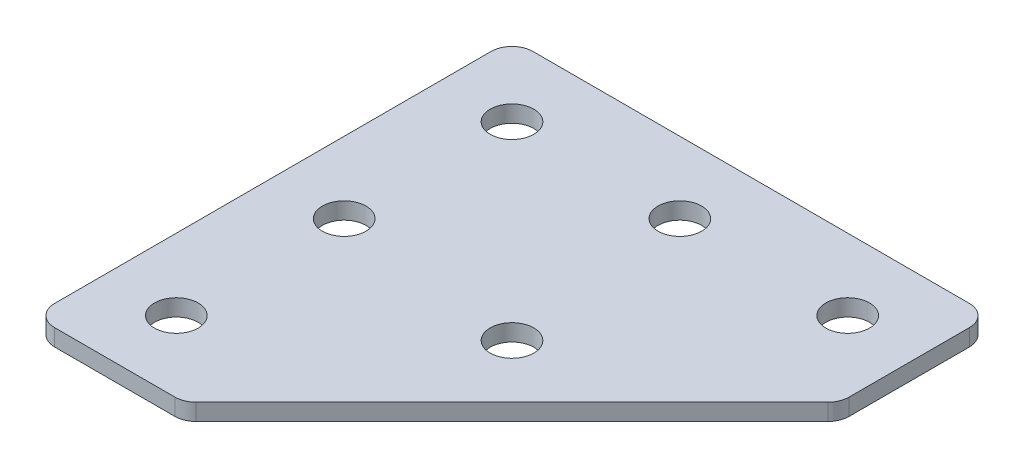
ISO-10303-21;
HEADER;
FILE_DESCRIPTION(('STEP AP214'),'2;1');
FILE_NAME('part.step','',(''),(''),'','','');
FILE_SCHEMA(('AUTOMOTIVE_DESIGN { 1 0 10303 214 1 1 1 1 }'));
ENDSEC;
DATA;
#1=APPLICATION_CONTEXT('core data for automotive mechanical design processes');
#2=APPLICATION_PROTOCOL_DEFINITION('international standard','automotive_design',2000,#1);
#3=PRODUCT_CONTEXT('',#1,'mechanical');
#4=PRODUCT('Part','Part','',(#3));
#5=PRODUCT_RELATED_PRODUCT_CATEGORY('part','',(#4));
#6=PRODUCT_DEFINITION_FORMATION('','',#4);
#7=PRODUCT_DEFINITION_CONTEXT('part definition',#1,'design');
#8=PRODUCT_DEFINITION('design','',#6,#7);
#9=PRODUCT_DEFINITION_SHAPE('','',#8);
#10=(LENGTH_UNIT() NAMED_UNIT(*) SI_UNIT(.MILLI.,.METRE.));
#11=(NAMED_UNIT(*) PLANE_ANGLE_UNIT() SI_UNIT($,.RADIAN.));
#12=(NAMED_UNIT(*) SI_UNIT($,.STERADIAN.) SOLID_ANGLE_UNIT());
#13=UNCERTAINTY_MEASURE_WITH_UNIT(LENGTH_MEASURE(1.E-05),#10,'distance_accuracy_value','');
#14=(GEOMETRIC_REPRESENTATION_CONTEXT(3) GLOBAL_UNCERTAINTY_ASSIGNED_CONTEXT((#13)) GLOBAL_UNIT_ASSIGNED_CONTEXT((#10,
#11,#12)) REPRESENTATION_CONTEXT('',''));
#15=CARTESIAN_POINT('',(0.,0.,0.));
#16=DIRECTION('',(0.,0.,1.));
#17=DIRECTION('',(1.,0.,0.));
#18=AXIS2_PLACEMENT_3D('',#15,#16,#17);
#19=CARTESIAN_POINT('',(-21.2659080191497,1.70798729371791,-21.4416391865665));
#20=DIRECTION('',(0.,-1.,0.));
#21=DIRECTION('',(0.,0.,-1.));
#22=AXIS2_PLACEMENT_3D('',#19,#20,#21);
#23=PLANE('',#22);
#24=CARTESIAN_POINT('',(1.30947077839158,1.70798729371791,1.13373961097471));
#25=DIRECTION('',(0.,-1.,0.));
#26=DIRECTION('',(0.,0.,-1.));
#27=AXIS2_PLACEMENT_3D('',#24,#25,#26);
#28=CIRCLE('',#27,2.6);
#29=CARTESIAN_POINT('',(1.30947077839158,1.70798729371791,-1.46626038902529));
#30=VERTEX_POINT('',#29);
#31=EDGE_CURVE('E214',#30,#30,#28,.T.);
#32=ORIENTED_EDGE('',*,*,#31,.F.);
#33=EDGE_LOOP('',(#32));
#34=FACE_BOUND('',#33,.T.);
#35=CARTESIAN_POINT('',(18.7340919808503,1.70798729371791,-21.4416391865665));
#36=DIRECTION('',(0.,1.,0.));
#37=DIRECTION('',(0.,0.,1.));
#38=AXIS2_PLACEMENT_3D('',#35,#36,#37);
#39=CIRCLE('',#38,2.6);
#40=CARTESIAN_POINT('',(18.7340919808503,1.70798729371791,-18.8416391865665));
#41=VERTEX_POINT('',#40);
#42=EDGE_CURVE('E208',#41,#41,#39,.T.);
#43=ORIENTED_EDGE('',*,*,#42,.T.);
#44=EDGE_LOOP('',(#43));
#45=FACE_BOUND('',#44,.T.);
#46=CARTESIAN_POINT('',(-21.2659080191497,1.70798729371791,18.5583608134335));
#47=DIRECTION('',(0.,1.,0.));
#48=DIRECTION('',(0.,0.,1.));
#49=AXIS2_PLACEMENT_3D('',#46,#47,#48);
#50=CIRCLE('',#49,2.6);
#51=CARTESIAN_POINT('',(-21.2659080191497,1.70798729371791,21.1583608134335));
#52=VERTEX_POINT('',#51);
#53=EDGE_CURVE('E202',#52,#52,#50,.T.);
#54=ORIENTED_EDGE('',*,*,#53,.T.);
#55=EDGE_LOOP('',(#54));
#56=FACE_BOUND('',#55,.T.);
#57=CARTESIAN_POINT('',(-21.2659080191497,1.70798729371791,-1.44163918656654));
#58=DIRECTION('',(0.,1.,0.));
#59=DIRECTION('',(0.,0.,1.));
#60=AXIS2_PLACEMENT_3D('',#57,#58,#59);
#61=CIRCLE('',#60,2.6);
#62=CARTESIAN_POINT('',(-21.2659080191497,1.70798729371791,1.15836081343346));
#63=VERTEX_POINT('',#62);
#64=EDGE_CURVE('E196',#63,#63,#61,.T.);
#65=ORIENTED_EDGE('',*,*,#64,.T.);
#66=EDGE_LOOP('',(#65));
#67=FACE_BOUND('',#66,.T.);
#68=CARTESIAN_POINT('',(-1.26590801914966,1.70798729371791,-21.4416391865665));
#69=DIRECTION('',(0.,1.,0.));
#70=DIRECTION('',(0.,0.,1.));
#71=AXIS2_PLACEMENT_3D('',#68,#69,#70);
#72=CIRCLE('',#71,2.6);
#73=CARTESIAN_POINT('',(-1.26590801914966,1.70798729371791,-18.8416391865665));
#74=VERTEX_POINT('',#73);
#75=EDGE_CURVE('E190',#74,#74,#72,.T.);
#76=ORIENTED_EDGE('',*,*,#75,.T.);
#77=EDGE_LOOP('',(#76));
#78=FACE_BOUND('',#77,.T.);
#79=CARTESIAN_POINT('',(-21.2659080191497,1.70798729371791,-21.4416391865665));
#80=DIRECTION('',(0.,1.,0.));
#81=DIRECTION('',(0.,0.,1.));
#82=AXIS2_PLACEMENT_3D('',#79,#80,#81);
#83=CIRCLE('',#82,2.6);
#84=CARTESIAN_POINT('',(-21.2659080191497,1.70798729371791,-18.8416391865665));
#85=VERTEX_POINT('',#84);
#86=EDGE_CURVE('E180',#85,#85,#83,.T.);
#87=ORIENTED_EDGE('',*,*,#86,.T.);
#88=EDGE_LOOP('',(#87));
#89=FACE_BOUND('',#88,.T.);
#90=DIRECTION('',(1.,0.,0.));
#91=VECTOR('',#90,1.);
#92=CARTESIAN_POINT('',(-29.7659080191497,1.70798729371791,27.0583608134334));
#93=LINE('',#92,#91);
#94=CARTESIAN_POINT('',(-27.2659080191497,1.70798729371791,27.0583608134334));
#95=VERTEX_POINT('',#94);
#96=CARTESIAN_POINT('',(-12.922762268642,1.70798729371791,27.0583608134334));
#97=VERTEX_POINT('',#96);
#98=EDGE_CURVE('E183',#95,#97,#93,.T.);
#99=ORIENTED_EDGE('',*,*,#98,.F.);
#100=CARTESIAN_POINT('',(-27.2659080191497,1.70798729371791,24.5583608134334));
#101=DIRECTION('',(0.,-1.,0.));
#102=DIRECTION('',(0.,0.,-1.));
#103=AXIS2_PLACEMENT_3D('',#100,#101,#102);
#104=CIRCLE('',#103,2.5);
#105=CARTESIAN_POINT('',(-29.7659080191497,1.70798729371791,24.5583608134334));
#106=VERTEX_POINT('',#105);
#107=EDGE_CURVE('E147',#95,#106,#104,.T.);
#108=ORIENTED_EDGE('',*,*,#107,.T.);
#109=DIRECTION('',(0.,0.,1.));
#110=VECTOR('',#109,1.);
#111=CARTESIAN_POINT('',(-29.7659080191497,1.70798729371791,-29.9416391865666));
#112=LINE('',#111,#110);
#113=CARTESIAN_POINT('',(-29.7659080191497,1.70798729371791,-27.4416391865666));
#114=VERTEX_POINT('',#113);
#115=EDGE_CURVE('E166',#114,#106,#112,.T.);
#116=ORIENTED_EDGE('',*,*,#115,.F.);
#117=CARTESIAN_POINT('',(-27.2659080191497,1.70798729371791,-27.4416391865666));
#118=DIRECTION('',(0.,-1.,0.));
#119=DIRECTION('',(0.,0.,-1.));
#120=AXIS2_PLACEMENT_3D('',#117,#118,#119);
#121=CIRCLE('',#120,2.5);
#122=CARTESIAN_POINT('',(-27.2659080191497,1.70798729371791,-29.9416391865666));
#123=VERTEX_POINT('',#122);
#124=EDGE_CURVE('E119',#114,#123,#121,.T.);
#125=ORIENTED_EDGE('',*,*,#124,.T.);
#126=DIRECTION('',(-1.,0.,0.));
#127=VECTOR('',#126,1.);
#128=CARTESIAN_POINT('',(27.2340919808503,1.70798729371791,-29.9416391865666));
#129=LINE('',#128,#127);
#130=CARTESIAN_POINT('',(24.7340919808503,1.70798729371791,-29.9416391865666));
#131=VERTEX_POINT('',#130);
#132=EDGE_CURVE('E162',#131,#123,#129,.T.);
#133=ORIENTED_EDGE('',*,*,#132,.F.);
#134=CARTESIAN_POINT('',(24.7340919808503,1.70798729371791,-27.4416391865666));
#135=DIRECTION('',(0.,-1.,0.));
#136=DIRECTION('',(0.,0.,-1.));
#137=AXIS2_PLACEMENT_3D('',#134,#135,#136);
#138=CIRCLE('',#137,2.5);
#139=CARTESIAN_POINT('',(27.2340919808503,1.70798729371791,-27.4416391865666));
#140=VERTEX_POINT('',#139);
#141=EDGE_CURVE('E145',#131,#140,#138,.T.);
#142=ORIENTED_EDGE('',*,*,#141,.T.);
#143=DIRECTION('',(0.,0.,-1.));
#144=VECTOR('',#143,1.);
#145=CARTESIAN_POINT('',(27.2340919808503,1.70798729371791,-12.0629595301262));
#146=LINE('',#145,#144);
#147=CARTESIAN_POINT('',(27.2340919808503,1.70798729371791,-13.0984934360589));
#148=VERTEX_POINT('',#147);
#149=EDGE_CURVE('E120',#148,#140,#146,.T.);
#150=ORIENTED_EDGE('',*,*,#149,.F.);
#151=CARTESIAN_POINT('',(24.7340919808503,1.70798729371791,-13.0984934360589));
#152=DIRECTION('',(0.,-1.,0.));
#153=DIRECTION('',(0.,0.,-1.));
#154=AXIS2_PLACEMENT_3D('',#151,#152,#153);
#155=CIRCLE('',#154,2.5);
#156=CARTESIAN_POINT('',(26.5018589338166,1.70798729371791,-11.3307264830925));
#157=VERTEX_POINT('',#156);
#158=EDGE_CURVE('E31',#148,#157,#155,.T.);
#159=ORIENTED_EDGE('',*,*,#158,.T.);
#160=DIRECTION('',(0.707106781186547,0.,-0.707106781186548));
#161=VECTOR('',#160,1.);
#162=CARTESIAN_POINT('',(-11.8872283627092,1.70798729371791,27.0583608134334));
#163=LINE('',#162,#161);
#164=CARTESIAN_POINT('',(-11.1549953156756,1.70798729371791,26.3261277663998));
#165=VERTEX_POINT('',#164);
#166=EDGE_CURVE('E125',#165,#157,#163,.T.);
#167=ORIENTED_EDGE('',*,*,#166,.F.);
#168=CARTESIAN_POINT('',(-12.922762268642,1.70798729371791,24.5583608134334));
#169=DIRECTION('',(0.,-1.,0.));
#170=DIRECTION('',(0.,0.,-1.));
#171=AXIS2_PLACEMENT_3D('',#168,#169,#170);
#172=CIRCLE('',#171,2.5);
#173=EDGE_CURVE('E141',#165,#97,#172,.T.);
#174=ORIENTED_EDGE('',*,*,#173,.T.);
#175=EDGE_LOOP('',(#99,#108,#116,#125,#133,#142,#150,#159,#167,#174));
#176=FACE_BOUND('',#175,.T.);
#177=ADVANCED_FACE('F16',(#34,#45,#56,#67,#78,#89,#176),#23,.T.);
#178=CARTESIAN_POINT('',(27.2340919808503,1.70798729371791,-29.9416391865666));
#179=DIRECTION('',(0.,0.,-1.));
#180=DIRECTION('',(-1.,0.,0.));
#181=AXIS2_PLACEMENT_3D('',#178,#179,#180);
#182=PLANE('',#181);
#183=DIRECTION('',(-1.,0.,0.));
#184=VECTOR('',#183,1.);
#185=CARTESIAN_POINT('',(27.2340919808503,3.70798729371791,-29.9416391865666));
#186=LINE('',#185,#184);
#187=CARTESIAN_POINT('',(24.7340919808503,3.70798729371791,-29.9416391865666));
#188=VERTEX_POINT('',#187);
#189=CARTESIAN_POINT('',(-27.2659080191497,3.70798729371791,-29.9416391865666));
#190=VERTEX_POINT('',#189);
#191=EDGE_CURVE('E99',#188,#190,#186,.T.);
#192=ORIENTED_EDGE('',*,*,#191,.F.);
#193=DIRECTION('',(0.,1.,0.));
#194=VECTOR('',#193,1.);
#195=CARTESIAN_POINT('',(24.7340919808503,1.70798729371791,-29.9416391865666));
#196=LINE('',#195,#194);
#197=EDGE_CURVE('E156',#188,#131,#196,.F.);
#198=ORIENTED_EDGE('',*,*,#197,.T.);
#199=ORIENTED_EDGE('',*,*,#132,.T.);
#200=DIRECTION('',(0.,1.,0.));
#201=VECTOR('',#200,1.);
#202=CARTESIAN_POINT('',(-27.2659080191497,1.70798729371791,-29.9416391865666));
#203=LINE('',#202,#201);
#204=EDGE_CURVE('E154',#123,#190,#203,.T.);
#205=ORIENTED_EDGE('',*,*,#204,.T.);
#206=EDGE_LOOP('',(#192,#198,#199,#205));
#207=FACE_BOUND('',#206,.T.);
#208=ADVANCED_FACE('F161',(#207),#182,.T.);
#209=CARTESIAN_POINT('',(27.2340919808503,1.70798729371791,-12.0629595301262));
#210=DIRECTION('',(1.,0.,0.));
#211=DIRECTION('',(0.,0.,-1.));
#212=AXIS2_PLACEMENT_3D('',#209,#210,#211);
#213=PLANE('',#212);
#214=ORIENTED_EDGE('',*,*,#149,.T.);
#215=DIRECTION('',(0.,1.,0.));
#216=VECTOR('',#215,1.);
#217=CARTESIAN_POINT('',(27.2340919808503,1.70798729371791,-27.4416391865666));
#218=LINE('',#217,#216);
#219=CARTESIAN_POINT('',(27.2340919808503,3.70798729371791,-27.4416391865666));
#220=VERTEX_POINT('',#219);
#221=EDGE_CURVE('E151',#140,#220,#218,.T.);
#222=ORIENTED_EDGE('',*,*,#221,.T.);
#223=DIRECTION('',(0.,0.,-1.));
#224=VECTOR('',#223,1.);
#225=CARTESIAN_POINT('',(27.2340919808503,3.70798729371791,-12.0629595301262));
#226=LINE('',#225,#224);
#227=CARTESIAN_POINT('',(27.2340919808503,3.70798729371791,-13.0984934360589));
#228=VERTEX_POINT('',#227);
#229=EDGE_CURVE('E128',#228,#220,#226,.T.);
#230=ORIENTED_EDGE('',*,*,#229,.F.);
#231=DIRECTION('',(0.,1.,0.));
#232=VECTOR('',#231,1.);
#233=CARTESIAN_POINT('',(27.2340919808503,1.70798729371791,-13.0984934360589));
#234=LINE('',#233,#232);
#235=EDGE_CURVE('E149',#228,#148,#234,.F.);
#236=ORIENTED_EDGE('',*,*,#235,.T.);
#237=EDGE_LOOP('',(#214,#222,#230,#236));
#238=FACE_BOUND('',#237,.T.);
#239=ADVANCED_FACE('F173',(#238),#213,.T.);
#240=CARTESIAN_POINT('',(-11.8872283627092,1.70798729371791,27.0583608134334));
#241=DIRECTION('',(0.707106781186548,0.,0.707106781186547));
#242=DIRECTION('',(0.707106781186547,0.,-0.707106781186548));
#243=AXIS2_PLACEMENT_3D('',#240,#241,#242);
#244=PLANE('',#243);
#245=ORIENTED_EDGE('',*,*,#166,.T.);
#246=DIRECTION('',(0.,1.,0.));
#247=VECTOR('',#246,1.);
#248=CARTESIAN_POINT('',(26.5018589338166,1.70798729371791,-11.3307264830925));
#249=LINE('',#248,#247);
#250=CARTESIAN_POINT('',(26.5018589338166,3.70798729371791,-11.3307264830925));
#251=VERTEX_POINT('',#250);
#252=EDGE_CURVE('E10',#157,#251,#249,.T.);
#253=ORIENTED_EDGE('',*,*,#252,.T.);
#254=DIRECTION('',(0.707106781186547,0.,-0.707106781186548));
#255=VECTOR('',#254,1.);
#256=CARTESIAN_POINT('',(-11.8872283627092,3.70798729371791,27.0583608134334));
#257=LINE('',#256,#255);
#258=CARTESIAN_POINT('',(-11.1549953156756,3.70798729371791,26.3261277663998));
#259=VERTEX_POINT('',#258);
#260=EDGE_CURVE('E176',#259,#251,#257,.T.);
#261=ORIENTED_EDGE('',*,*,#260,.F.);
#262=DIRECTION('',(0.,1.,0.));
#263=VECTOR('',#262,1.);
#264=CARTESIAN_POINT('',(-11.1549953156756,1.70798729371791,26.3261277663998));
#265=LINE('',#264,#263);
#266=EDGE_CURVE('E24',#259,#165,#265,.F.);
#267=ORIENTED_EDGE('',*,*,#266,.T.);
#268=EDGE_LOOP('',(#245,#253,#261,#267));
#269=FACE_BOUND('',#268,.T.);
#270=ADVANCED_FACE('F278',(#269),#244,.T.);
#271=CARTESIAN_POINT('',(-29.7659080191497,1.70798729371791,27.0583608134334));
#272=DIRECTION('',(0.,0.,1.));
#273=DIRECTION('',(1.,0.,0.));
#274=AXIS2_PLACEMENT_3D('',#271,#272,#273);
#275=PLANE('',#274);
#276=DIRECTION('',(1.,0.,0.));
#277=VECTOR('',#276,1.);
#278=CARTESIAN_POINT('',(-29.7659080191497,3.70798729371791,27.0583608134334));
#279=LINE('',#278,#277);
#280=CARTESIAN_POINT('',(-27.2659080191497,3.70798729371791,27.0583608134334));
#281=VERTEX_POINT('',#280);
#282=CARTESIAN_POINT('',(-12.922762268642,3.70798729371791,27.0583608134334));
#283=VERTEX_POINT('',#282);
#284=EDGE_CURVE('E115',#281,#283,#279,.T.);
#285=ORIENTED_EDGE('',*,*,#284,.F.);
#286=DIRECTION('',(0.,1.,0.));
#287=VECTOR('',#286,1.);
#288=CARTESIAN_POINT('',(-27.2659080191497,1.70798729371791,27.0583608134334));
#289=LINE('',#288,#287);
#290=EDGE_CURVE('E139',#281,#95,#289,.F.);
#291=ORIENTED_EDGE('',*,*,#290,.T.);
#292=ORIENTED_EDGE('',*,*,#98,.T.);
#293=DIRECTION('',(0.,1.,0.));
#294=VECTOR('',#293,1.);
#295=CARTESIAN_POINT('',(-12.922762268642,1.70798729371791,27.0583608134334));
#296=LINE('',#295,#294);
#297=EDGE_CURVE('E136',#97,#283,#296,.T.);
#298=ORIENTED_EDGE('',*,*,#297,.T.);
#299=EDGE_LOOP('',(#285,#291,#292,#298));
#300=FACE_BOUND('',#299,.T.);
#301=ADVANCED_FACE('F283',(#300),#275,.T.);
#302=CARTESIAN_POINT('',(-29.7659080191497,1.70798729371791,-29.9416391865666));
#303=DIRECTION('',(-1.,0.,0.));
#304=DIRECTION('',(0.,0.,1.));
#305=AXIS2_PLACEMENT_3D('',#302,#303,#304);
#306=PLANE('',#305);
#307=ORIENTED_EDGE('',*,*,#115,.T.);
#308=DIRECTION('',(0.,1.,0.));
#309=VECTOR('',#308,1.);
#310=CARTESIAN_POINT('',(-29.7659080191497,1.70798729371791,24.5583608134334));
#311=LINE('',#310,#309);
#312=CARTESIAN_POINT('',(-29.7659080191497,3.70798729371791,24.5583608134334));
#313=VERTEX_POINT('',#312);
#314=EDGE_CURVE('E114',#106,#313,#311,.T.);
#315=ORIENTED_EDGE('',*,*,#314,.T.);
#316=DIRECTION('',(0.,0.,1.));
#317=VECTOR('',#316,1.);
#318=CARTESIAN_POINT('',(-29.7659080191497,3.70798729371791,-29.9416391865666));
#319=LINE('',#318,#317);
#320=CARTESIAN_POINT('',(-29.7659080191497,3.70798729371791,-27.4416391865666));
#321=VERTEX_POINT('',#320);
#322=EDGE_CURVE('E97',#321,#313,#319,.T.);
#323=ORIENTED_EDGE('',*,*,#322,.F.);
#324=DIRECTION('',(0.,1.,0.));
#325=VECTOR('',#324,1.);
#326=CARTESIAN_POINT('',(-29.7659080191497,1.70798729371791,-27.4416391865666));
#327=LINE('',#326,#325);
#328=EDGE_CURVE('E111',#321,#114,#327,.F.);
#329=ORIENTED_EDGE('',*,*,#328,.T.);
#330=EDGE_LOOP('',(#307,#315,#323,#329));
#331=FACE_BOUND('',#330,.T.);
#332=ADVANCED_FACE('F110',(#331),#306,.T.);
#333=CARTESIAN_POINT('',(-21.2659080191497,3.70798729371791,-21.4416391865665));
#334=DIRECTION('',(0.,-1.,0.));
#335=DIRECTION('',(0.,0.,-1.));
#336=AXIS2_PLACEMENT_3D('',#333,#334,#335);
#337=PLANE('',#336);
#338=CARTESIAN_POINT('',(1.30947077839158,3.70798729371791,1.13373961097471));
#339=DIRECTION('',(0.,1.,0.));
#340=DIRECTION('',(0.,0.,1.));
#341=AXIS2_PLACEMENT_3D('',#338,#339,#340);
#342=CIRCLE('',#341,2.6);
#343=CARTESIAN_POINT('',(1.30947077839158,3.70798729371791,3.73373961097471));
#344=VERTEX_POINT('',#343);
#345=EDGE_CURVE('E219',#344,#344,#342,.T.);
#346=ORIENTED_EDGE('',*,*,#345,.F.);
#347=EDGE_LOOP('',(#346));
#348=FACE_BOUND('',#347,.T.);
#349=CARTESIAN_POINT('',(18.7340919808503,3.70798729371791,-21.4416391865665));
#350=DIRECTION('',(0.,1.,0.));
#351=DIRECTION('',(0.,0.,1.));
#352=AXIS2_PLACEMENT_3D('',#349,#350,#351);
#353=CIRCLE('',#352,2.6);
#354=CARTESIAN_POINT('',(18.7340919808503,3.70798729371791,-18.8416391865665));
#355=VERTEX_POINT('',#354);
#356=EDGE_CURVE('E211',#355,#355,#353,.T.);
#357=ORIENTED_EDGE('',*,*,#356,.F.);
#358=EDGE_LOOP('',(#357));
#359=FACE_BOUND('',#358,.T.);
#360=CARTESIAN_POINT('',(-21.2659080191497,3.70798729371791,18.5583608134335));
#361=DIRECTION('',(0.,1.,0.));
#362=DIRECTION('',(0.,0.,1.));
#363=AXIS2_PLACEMENT_3D('',#360,#361,#362);
#364=CIRCLE('',#363,2.6);
#365=CARTESIAN_POINT('',(-21.2659080191497,3.70798729371791,21.1583608134335));
#366=VERTEX_POINT('',#365);
#367=EDGE_CURVE('E205',#366,#366,#364,.T.);
#368=ORIENTED_EDGE('',*,*,#367,.F.);
#369=EDGE_LOOP('',(#368));
#370=FACE_BOUND('',#369,.T.);
#371=CARTESIAN_POINT('',(-21.2659080191497,3.70798729371791,-1.44163918656654));
#372=DIRECTION('',(0.,1.,0.));
#373=DIRECTION('',(0.,0.,1.));
#374=AXIS2_PLACEMENT_3D('',#371,#372,#373);
#375=CIRCLE('',#374,2.6);
#376=CARTESIAN_POINT('',(-21.2659080191497,3.70798729371791,1.15836081343346));
#377=VERTEX_POINT('',#376);
#378=EDGE_CURVE('E199',#377,#377,#375,.T.);
#379=ORIENTED_EDGE('',*,*,#378,.F.);
#380=EDGE_LOOP('',(#379));
#381=FACE_BOUND('',#380,.T.);
#382=CARTESIAN_POINT('',(-1.26590801914966,3.70798729371791,-21.4416391865665));
#383=DIRECTION('',(0.,1.,0.));
#384=DIRECTION('',(0.,0.,1.));
#385=AXIS2_PLACEMENT_3D('',#382,#383,#384);
#386=CIRCLE('',#385,2.6);
#387=CARTESIAN_POINT('',(-1.26590801914966,3.70798729371791,-18.8416391865665));
#388=VERTEX_POINT('',#387);
#389=EDGE_CURVE('E193',#388,#388,#386,.T.);
#390=ORIENTED_EDGE('',*,*,#389,.F.);
#391=EDGE_LOOP('',(#390));
#392=FACE_BOUND('',#391,.T.);
#393=CARTESIAN_POINT('',(-21.2659080191497,3.70798729371791,-21.4416391865665));
#394=DIRECTION('',(0.,1.,0.));
#395=DIRECTION('',(0.,0.,1.));
#396=AXIS2_PLACEMENT_3D('',#393,#394,#395);
#397=CIRCLE('',#396,2.6);
#398=CARTESIAN_POINT('',(-21.2659080191497,3.70798729371791,-18.8416391865665));
#399=VERTEX_POINT('',#398);
#400=EDGE_CURVE('E187',#399,#399,#397,.T.);
#401=ORIENTED_EDGE('',*,*,#400,.F.);
#402=EDGE_LOOP('',(#401));
#403=FACE_BOUND('',#402,.T.);
#404=ORIENTED_EDGE('',*,*,#322,.T.);
#405=CARTESIAN_POINT('',(-27.2659080191497,3.70798729371791,24.5583608134334));
#406=DIRECTION('',(0.,-1.,0.));
#407=DIRECTION('',(0.,0.,-1.));
#408=AXIS2_PLACEMENT_3D('',#405,#406,#407);
#409=CIRCLE('',#408,2.5);
#410=EDGE_CURVE('E134',#313,#281,#409,.F.);
#411=ORIENTED_EDGE('',*,*,#410,.T.);
#412=ORIENTED_EDGE('',*,*,#284,.T.);
#413=CARTESIAN_POINT('',(-12.922762268642,3.70798729371791,24.5583608134334));
#414=DIRECTION('',(0.,-1.,0.));
#415=DIRECTION('',(0.,0.,-1.));
#416=AXIS2_PLACEMENT_3D('',#413,#414,#415);
#417=CIRCLE('',#416,2.5);
#418=EDGE_CURVE('E122',#283,#259,#417,.F.);
#419=ORIENTED_EDGE('',*,*,#418,.T.);
#420=ORIENTED_EDGE('',*,*,#260,.T.);
#421=CARTESIAN_POINT('',(24.7340919808503,3.70798729371791,-13.0984934360589));
#422=DIRECTION('',(0.,-1.,0.));
#423=DIRECTION('',(0.,0.,-1.));
#424=AXIS2_PLACEMENT_3D('',#421,#422,#423);
#425=CIRCLE('',#424,2.5);
#426=EDGE_CURVE('E105',#251,#228,#425,.F.);
#427=ORIENTED_EDGE('',*,*,#426,.T.);
#428=ORIENTED_EDGE('',*,*,#229,.T.);
#429=CARTESIAN_POINT('',(24.7340919808503,3.70798729371791,-27.4416391865666));
#430=DIRECTION('',(0.,-1.,0.));
#431=DIRECTION('',(0.,0.,-1.));
#432=AXIS2_PLACEMENT_3D('',#429,#430,#431);
#433=CIRCLE('',#432,2.5);
#434=EDGE_CURVE('E104',#220,#188,#433,.F.);
#435=ORIENTED_EDGE('',*,*,#434,.T.);
#436=ORIENTED_EDGE('',*,*,#191,.T.);
#437=CARTESIAN_POINT('',(-27.2659080191497,3.70798729371791,-27.4416391865666));
#438=DIRECTION('',(0.,-1.,0.));
#439=DIRECTION('',(0.,0.,-1.));
#440=AXIS2_PLACEMENT_3D('',#437,#438,#439);
#441=CIRCLE('',#440,2.5);
#442=EDGE_CURVE('E94',#190,#321,#441,.F.);
#443=ORIENTED_EDGE('',*,*,#442,.T.);
#444=EDGE_LOOP('',(#404,#411,#412,#419,#420,#427,#428,#435,#436,#443));
#445=FACE_BOUND('',#444,.T.);
#446=ADVANCED_FACE('F96',(#348,#359,#370,#381,#392,#403,#445),#337,.F.);
#447=CARTESIAN_POINT('',(-21.2659080191497,1.70798729371791,-21.4416391865665));
#448=DIRECTION('',(0.,1.,0.));
#449=DIRECTION('',(0.,0.,1.));
#450=AXIS2_PLACEMENT_3D('',#447,#448,#449);
#451=CYLINDRICAL_SURFACE('',#450,2.6);
#452=ORIENTED_EDGE('',*,*,#86,.F.);
#453=EDGE_LOOP('',(#452));
#454=FACE_BOUND('',#453,.T.);
#455=ORIENTED_EDGE('',*,*,#400,.T.);
#456=EDGE_LOOP('',(#455));
#457=FACE_BOUND('',#456,.T.);
#458=ADVANCED_FACE('F227',(#454,#457),#451,.F.);
#459=CARTESIAN_POINT('',(-1.26590801914966,1.70798729371791,-21.4416391865665));
#460=DIRECTION('',(0.,1.,0.));
#461=DIRECTION('',(0.,0.,1.));
#462=AXIS2_PLACEMENT_3D('',#459,#460,#461);
#463=CYLINDRICAL_SURFACE('',#462,2.6);
#464=ORIENTED_EDGE('',*,*,#75,.F.);
#465=EDGE_LOOP('',(#464));
#466=FACE_BOUND('',#465,.T.);
#467=ORIENTED_EDGE('',*,*,#389,.T.);
#468=EDGE_LOOP('',(#467));
#469=FACE_BOUND('',#468,.T.);
#470=ADVANCED_FACE('F240',(#466,#469),#463,.F.);
#471=CARTESIAN_POINT('',(-21.2659080191497,1.70798729371791,-1.44163918656654));
#472=DIRECTION('',(0.,1.,0.));
#473=DIRECTION('',(0.,0.,1.));
#474=AXIS2_PLACEMENT_3D('',#471,#472,#473);
#475=CYLINDRICAL_SURFACE('',#474,2.6);
#476=ORIENTED_EDGE('',*,*,#64,.F.);
#477=EDGE_LOOP('',(#476));
#478=FACE_BOUND('',#477,.T.);
#479=ORIENTED_EDGE('',*,*,#378,.T.);
#480=EDGE_LOOP('',(#479));
#481=FACE_BOUND('',#480,.T.);
#482=ADVANCED_FACE('F247',(#478,#481),#475,.F.);
#483=CARTESIAN_POINT('',(-21.2659080191497,1.70798729371791,18.5583608134335));
#484=DIRECTION('',(0.,1.,0.));
#485=DIRECTION('',(0.,0.,1.));
#486=AXIS2_PLACEMENT_3D('',#483,#484,#485);
#487=CYLINDRICAL_SURFACE('',#486,2.6);
#488=ORIENTED_EDGE('',*,*,#53,.F.);
#489=EDGE_LOOP('',(#488));
#490=FACE_BOUND('',#489,.T.);
#491=ORIENTED_EDGE('',*,*,#367,.T.);
#492=EDGE_LOOP('',(#491));
#493=FACE_BOUND('',#492,.T.);
#494=ADVANCED_FACE('F343',(#490,#493),#487,.F.);
#495=CARTESIAN_POINT('',(18.7340919808503,1.70798729371791,-21.4416391865665));
#496=DIRECTION('',(0.,1.,0.));
#497=DIRECTION('',(0.,0.,1.));
#498=AXIS2_PLACEMENT_3D('',#495,#496,#497);
#499=CYLINDRICAL_SURFACE('',#498,2.6);
#500=ORIENTED_EDGE('',*,*,#42,.F.);
#501=EDGE_LOOP('',(#500));
#502=FACE_BOUND('',#501,.T.);
#503=ORIENTED_EDGE('',*,*,#356,.T.);
#504=EDGE_LOOP('',(#503));
#505=FACE_BOUND('',#504,.T.);
#506=ADVANCED_FACE('F265',(#502,#505),#499,.F.);
#507=CARTESIAN_POINT('',(-27.2659080191497,1.70798729371791,24.5583608134334));
#508=DIRECTION('',(0.,1.,0.));
#509=DIRECTION('',(0.,0.,1.));
#510=AXIS2_PLACEMENT_3D('',#507,#508,#509);
#511=CYLINDRICAL_SURFACE('',#510,2.5);
#512=ORIENTED_EDGE('',*,*,#107,.F.);
#513=ORIENTED_EDGE('',*,*,#290,.F.);
#514=ORIENTED_EDGE('',*,*,#410,.F.);
#515=ORIENTED_EDGE('',*,*,#314,.F.);
#516=EDGE_LOOP('',(#512,#513,#514,#515));
#517=FACE_BOUND('',#516,.T.);
#518=ADVANCED_FACE('F262',(#517),#511,.T.);
#519=CARTESIAN_POINT('',(24.7340919808503,1.70798729371791,-27.4416391865666));
#520=DIRECTION('',(0.,1.,0.));
#521=DIRECTION('',(0.,0.,1.));
#522=AXIS2_PLACEMENT_3D('',#519,#520,#521);
#523=CYLINDRICAL_SURFACE('',#522,2.5);
#524=ORIENTED_EDGE('',*,*,#141,.F.);
#525=ORIENTED_EDGE('',*,*,#197,.F.);
#526=ORIENTED_EDGE('',*,*,#434,.F.);
#527=ORIENTED_EDGE('',*,*,#221,.F.);
#528=EDGE_LOOP('',(#524,#525,#526,#527));
#529=FACE_BOUND('',#528,.T.);
#530=ADVANCED_FACE('F169',(#529),#523,.T.);
#531=CARTESIAN_POINT('',(-27.2659080191497,1.70798729371791,-27.4416391865666));
#532=DIRECTION('',(0.,1.,0.));
#533=DIRECTION('',(0.,0.,1.));
#534=AXIS2_PLACEMENT_3D('',#531,#532,#533);
#535=CYLINDRICAL_SURFACE('',#534,2.5);
#536=ORIENTED_EDGE('',*,*,#124,.F.);
#537=ORIENTED_EDGE('',*,*,#328,.F.);
#538=ORIENTED_EDGE('',*,*,#442,.F.);
#539=ORIENTED_EDGE('',*,*,#204,.F.);
#540=EDGE_LOOP('',(#536,#537,#538,#539));
#541=FACE_BOUND('',#540,.T.);
#542=ADVANCED_FACE('F118',(#541),#535,.T.);
#543=CARTESIAN_POINT('',(24.7340919808503,1.70798729371791,-13.0984934360589));
#544=DIRECTION('',(0.,1.,0.));
#545=DIRECTION('',(0.,0.,1.));
#546=AXIS2_PLACEMENT_3D('',#543,#544,#545);
#547=CYLINDRICAL_SURFACE('',#546,2.5);
#548=ORIENTED_EDGE('',*,*,#158,.F.);
#549=ORIENTED_EDGE('',*,*,#235,.F.);
#550=ORIENTED_EDGE('',*,*,#426,.F.);
#551=ORIENTED_EDGE('',*,*,#252,.F.);
#552=EDGE_LOOP('',(#548,#549,#550,#551));
#553=FACE_BOUND('',#552,.T.);
#554=ADVANCED_FACE('F270',(#553),#547,.T.);
#555=CARTESIAN_POINT('',(-12.922762268642,1.70798729371791,24.5583608134334));
#556=DIRECTION('',(0.,1.,0.));
#557=DIRECTION('',(0.,0.,1.));
#558=AXIS2_PLACEMENT_3D('',#555,#556,#557);
#559=CYLINDRICAL_SURFACE('',#558,2.5);
#560=ORIENTED_EDGE('',*,*,#173,.F.);
#561=ORIENTED_EDGE('',*,*,#266,.F.);
#562=ORIENTED_EDGE('',*,*,#418,.F.);
#563=ORIENTED_EDGE('',*,*,#297,.F.);
#564=EDGE_LOOP('',(#560,#561,#562,#563));
#565=FACE_BOUND('',#564,.T.);
#566=ADVANCED_FACE('F18',(#565),#559,.T.);
#567=CARTESIAN_POINT('',(1.30947077839158,-6.29201270628209,1.13373961097471));
#568=DIRECTION('',(0.,1.,0.));
#569=DIRECTION('',(0.,0.,1.));
#570=AXIS2_PLACEMENT_3D('',#567,#568,#569);
#571=CYLINDRICAL_SURFACE('',#570,2.6);
#572=ORIENTED_EDGE('',*,*,#31,.T.);
#573=EDGE_LOOP('',(#572));
#574=FACE_BOUND('',#573,.T.);
#575=ORIENTED_EDGE('',*,*,#345,.T.);
#576=EDGE_LOOP('',(#575));
#577=FACE_BOUND('',#576,.T.);
#578=ADVANCED_FACE('F223',(#574,#577),#571,.F.);
#579=CLOSED_SHELL('',(#177,#208,#239,#270,#301,#332,#446,#458,#470,#482,#494,#506,#518,#530,
#542,#554,#566,#578));
#580=MANIFOLD_SOLID_BREP('B1',#579);
#581=ADVANCED_BREP_SHAPE_REPRESENTATION('',(#18,#580),#14);
#582=SHAPE_DEFINITION_REPRESENTATION(#9,#581);
ENDSEC;
END-ISO-10303-21;
